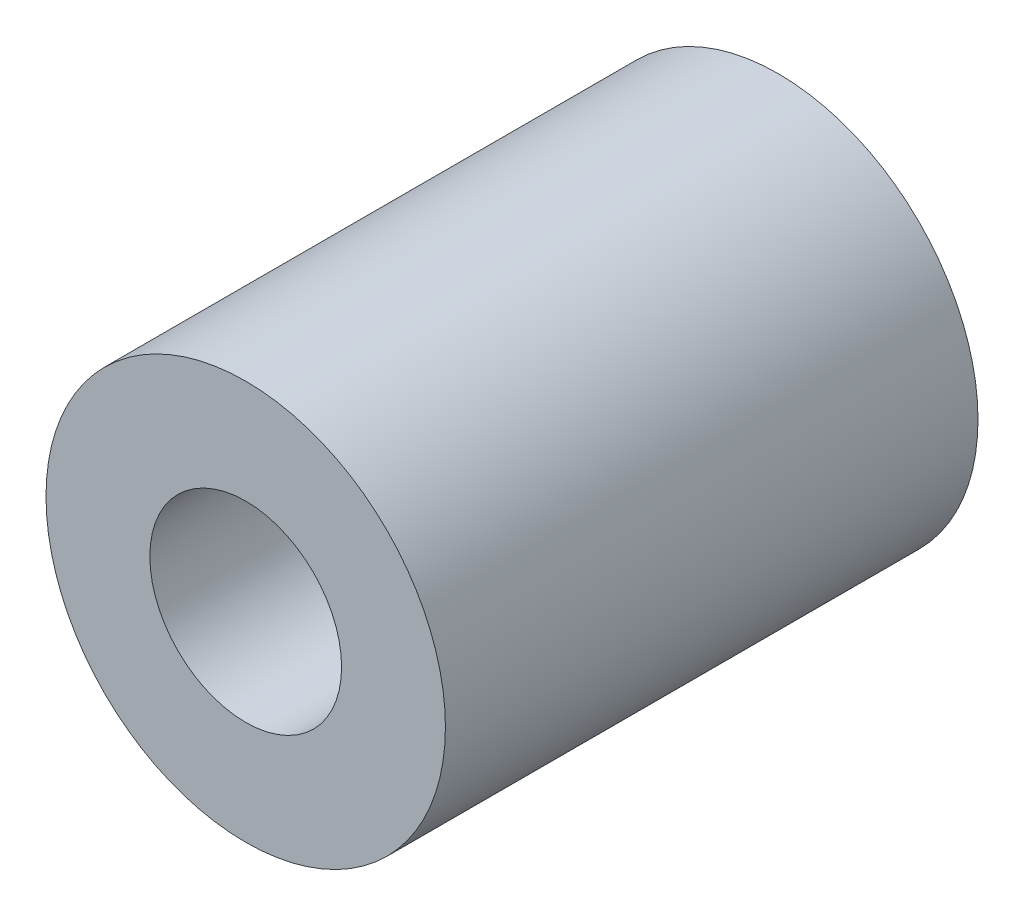
ISO-10303-21;
HEADER;
FILE_DESCRIPTION(('STEP AP214'),'2;1');
FILE_NAME('part.step','',(''),(''),'','','');
FILE_SCHEMA(('AUTOMOTIVE_DESIGN { 1 0 10303 214 1 1 1 1 }'));
ENDSEC;
DATA;
#1=APPLICATION_CONTEXT('core data for automotive mechanical design processes');
#2=APPLICATION_PROTOCOL_DEFINITION('international standard','automotive_design',2000,#1);
#3=PRODUCT_CONTEXT('',#1,'mechanical');
#4=PRODUCT('Part','Part','',(#3));
#5=PRODUCT_RELATED_PRODUCT_CATEGORY('part','',(#4));
#6=PRODUCT_DEFINITION_FORMATION('','',#4);
#7=PRODUCT_DEFINITION_CONTEXT('part definition',#1,'design');
#8=PRODUCT_DEFINITION('design','',#6,#7);
#9=PRODUCT_DEFINITION_SHAPE('','',#8);
#10=(LENGTH_UNIT() NAMED_UNIT(*) SI_UNIT(.MILLI.,.METRE.));
#11=(NAMED_UNIT(*) PLANE_ANGLE_UNIT() SI_UNIT($,.RADIAN.));
#12=(NAMED_UNIT(*) SI_UNIT($,.STERADIAN.) SOLID_ANGLE_UNIT());
#13=UNCERTAINTY_MEASURE_WITH_UNIT(LENGTH_MEASURE(1.E-05),#10,'distance_accuracy_value','');
#14=(GEOMETRIC_REPRESENTATION_CONTEXT(3) GLOBAL_UNCERTAINTY_ASSIGNED_CONTEXT((#13)) GLOBAL_UNIT_ASSIGNED_CONTEXT((#10,
#11,#12)) REPRESENTATION_CONTEXT('',''));
#15=CARTESIAN_POINT('',(0.,0.,0.));
#16=DIRECTION('',(0.,0.,1.));
#17=DIRECTION('',(1.,0.,0.));
#18=AXIS2_PLACEMENT_3D('',#15,#16,#17);
#19=CARTESIAN_POINT('',(0.,0.,3.175));
#20=DIRECTION('',(0.,0.,1.));
#21=DIRECTION('',(1.,0.,0.));
#22=AXIS2_PLACEMENT_3D('',#19,#20,#21);
#23=PLANE('',#22);
#24=CARTESIAN_POINT('',(0.,0.,3.175));
#25=DIRECTION('',(0.,0.,1.));
#26=DIRECTION('',(1.,0.,0.));
#27=AXIS2_PLACEMENT_3D('',#24,#25,#26);
#28=CIRCLE('',#27,2.38125);
#29=CARTESIAN_POINT('',(2.38125,0.,3.175));
#30=VERTEX_POINT('',#29);
#31=EDGE_CURVE('E10',#30,#30,#28,.T.);
#32=ORIENTED_EDGE('',*,*,#31,.T.);
#33=EDGE_LOOP('',(#32));
#34=FACE_BOUND('',#33,.T.);
#35=CARTESIAN_POINT('',(0.,0.,3.175));
#36=DIRECTION('',(0.,0.,1.));
#37=DIRECTION('',(1.,0.,0.));
#38=AXIS2_PLACEMENT_3D('',#35,#36,#37);
#39=CIRCLE('',#38,1.143);
#40=CARTESIAN_POINT('',(1.143,0.,3.175));
#41=VERTEX_POINT('',#40);
#42=EDGE_CURVE('E41',#41,#41,#39,.T.);
#43=ORIENTED_EDGE('',*,*,#42,.F.);
#44=EDGE_LOOP('',(#43));
#45=FACE_BOUND('',#44,.T.);
#46=ADVANCED_FACE('F30',(#34,#45),#23,.T.);
#47=CARTESIAN_POINT('',(0.,0.,-3.175));
#48=DIRECTION('',(0.,0.,1.));
#49=DIRECTION('',(1.,0.,0.));
#50=AXIS2_PLACEMENT_3D('',#47,#48,#49);
#51=PLANE('',#50);
#52=CARTESIAN_POINT('',(0.,0.,-3.175));
#53=DIRECTION('',(0.,0.,1.));
#54=DIRECTION('',(1.,0.,0.));
#55=AXIS2_PLACEMENT_3D('',#52,#53,#54);
#56=CIRCLE('',#55,2.38125);
#57=CARTESIAN_POINT('',(2.38125,0.,-3.175));
#58=VERTEX_POINT('',#57);
#59=EDGE_CURVE('E34',#58,#58,#56,.T.);
#60=ORIENTED_EDGE('',*,*,#59,.F.);
#61=EDGE_LOOP('',(#60));
#62=FACE_BOUND('',#61,.T.);
#63=CARTESIAN_POINT('',(0.,0.,-3.175));
#64=DIRECTION('',(0.,0.,1.));
#65=DIRECTION('',(1.,0.,0.));
#66=AXIS2_PLACEMENT_3D('',#63,#64,#65);
#67=CIRCLE('',#66,1.143);
#68=CARTESIAN_POINT('',(1.143,0.,-3.175));
#69=VERTEX_POINT('',#68);
#70=EDGE_CURVE('E43',#69,#69,#67,.T.);
#71=ORIENTED_EDGE('',*,*,#70,.T.);
#72=EDGE_LOOP('',(#71));
#73=FACE_BOUND('',#72,.T.);
#74=ADVANCED_FACE('F53',(#62,#73),#51,.F.);
#75=CARTESIAN_POINT('',(0.,0.,3.175));
#76=DIRECTION('',(0.,0.,-1.));
#77=DIRECTION('',(-1.,0.,0.));
#78=AXIS2_PLACEMENT_3D('',#75,#76,#77);
#79=CYLINDRICAL_SURFACE('',#78,2.38125);
#80=ORIENTED_EDGE('',*,*,#31,.F.);
#81=EDGE_LOOP('',(#80));
#82=FACE_BOUND('',#81,.T.);
#83=ORIENTED_EDGE('',*,*,#59,.T.);
#84=EDGE_LOOP('',(#83));
#85=FACE_BOUND('',#84,.T.);
#86=ADVANCED_FACE('F32',(#82,#85),#79,.T.);
#87=CARTESIAN_POINT('',(0.,0.,3.175));
#88=DIRECTION('',(0.,0.,-1.));
#89=DIRECTION('',(-1.,0.,0.));
#90=AXIS2_PLACEMENT_3D('',#87,#88,#89);
#91=CYLINDRICAL_SURFACE('',#90,1.143);
#92=ORIENTED_EDGE('',*,*,#42,.T.);
#93=EDGE_LOOP('',(#92));
#94=FACE_BOUND('',#93,.T.);
#95=ORIENTED_EDGE('',*,*,#70,.F.);
#96=EDGE_LOOP('',(#95));
#97=FACE_BOUND('',#96,.T.);
#98=ADVANCED_FACE('F49',(#94,#97),#91,.F.);
#99=CLOSED_SHELL('',(#46,#74,#86,#98));
#100=MANIFOLD_SOLID_BREP('B2',#99);
#101=ADVANCED_BREP_SHAPE_REPRESENTATION('',(#18,#100),#14);
#102=SHAPE_DEFINITION_REPRESENTATION(#9,#101);
ENDSEC;
END-ISO-10303-21;
